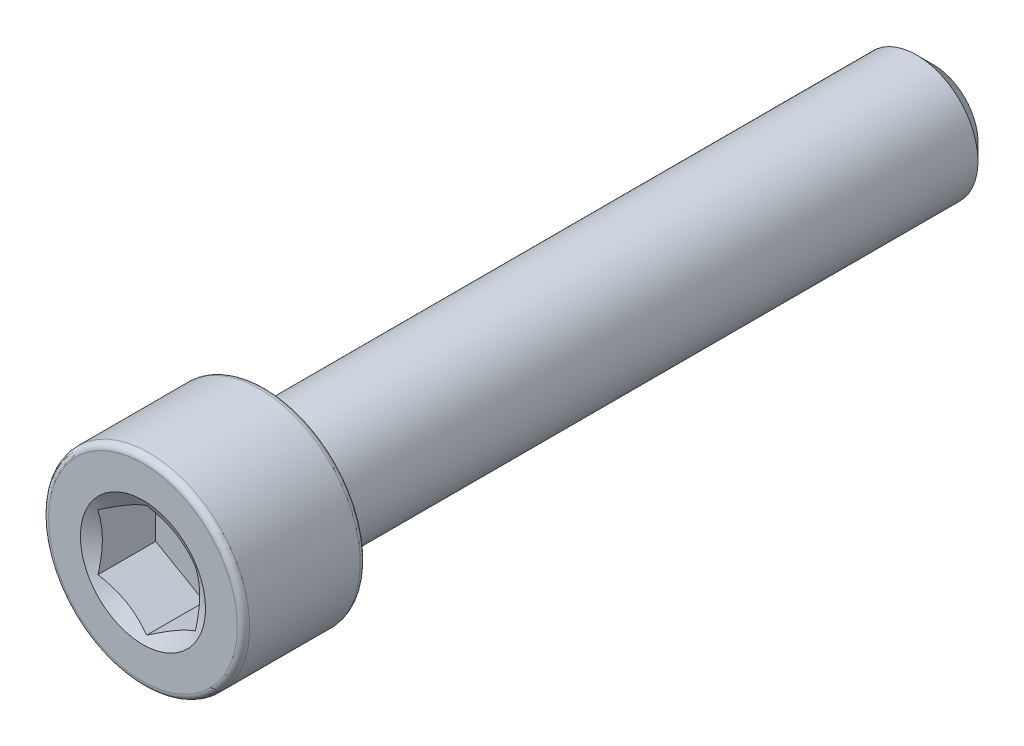
ISO-10303-21;
HEADER;
FILE_DESCRIPTION(('STEP AP214'),'2;1');
FILE_NAME('part.step','',(''),(''),'','','');
FILE_SCHEMA(('AUTOMOTIVE_DESIGN { 1 0 10303 214 1 1 1 1 }'));
ENDSEC;
DATA;
#1=APPLICATION_CONTEXT('core data for automotive mechanical design processes');
#2=APPLICATION_PROTOCOL_DEFINITION('international standard','automotive_design',2000,#1);
#3=PRODUCT_CONTEXT('',#1,'mechanical');
#4=PRODUCT('Part','Part','',(#3));
#5=PRODUCT_RELATED_PRODUCT_CATEGORY('part','',(#4));
#6=PRODUCT_DEFINITION_FORMATION('','',#4);
#7=PRODUCT_DEFINITION_CONTEXT('part definition',#1,'design');
#8=PRODUCT_DEFINITION('design','',#6,#7);
#9=PRODUCT_DEFINITION_SHAPE('','',#8);
#10=(LENGTH_UNIT() NAMED_UNIT(*) SI_UNIT(.MILLI.,.METRE.));
#11=(NAMED_UNIT(*) PLANE_ANGLE_UNIT() SI_UNIT($,.RADIAN.));
#12=(NAMED_UNIT(*) SI_UNIT($,.STERADIAN.) SOLID_ANGLE_UNIT());
#13=UNCERTAINTY_MEASURE_WITH_UNIT(LENGTH_MEASURE(1.E-05),#10,'distance_accuracy_value','');
#14=(GEOMETRIC_REPRESENTATION_CONTEXT(3) GLOBAL_UNCERTAINTY_ASSIGNED_CONTEXT((#13)) GLOBAL_UNIT_ASSIGNED_CONTEXT((#10,
#11,#12)) REPRESENTATION_CONTEXT('',''));
#15=CARTESIAN_POINT('',(0.,0.,0.));
#16=DIRECTION('',(0.,0.,1.));
#17=DIRECTION('',(1.,0.,0.));
#18=AXIS2_PLACEMENT_3D('',#15,#16,#17);
#19=CARTESIAN_POINT('',(0.,0.,-11.2776));
#20=DIRECTION('',(0.,0.,-1.));
#21=DIRECTION('',(-1.,0.,0.));
#22=AXIS2_PLACEMENT_3D('',#19,#20,#21);
#23=PLANE('',#22);
#24=CARTESIAN_POINT('',(0.,0.,-11.2776));
#25=DIRECTION('',(0.,0.,-1.));
#26=DIRECTION('',(-1.,0.,0.));
#27=AXIS2_PLACEMENT_3D('',#24,#25,#26);
#28=CIRCLE('',#27,1.27635000000001);
#29=CARTESIAN_POINT('',(-1.27635000000001,0.,-11.2776));
#30=VERTEX_POINT('',#29);
#31=EDGE_CURVE('E57',#30,#30,#28,.T.);
#32=ORIENTED_EDGE('',*,*,#31,.T.);
#33=EDGE_LOOP('',(#32));
#34=FACE_BOUND('',#33,.T.);
#35=ADVANCED_FACE('F43',(#34),#23,.T.);
#36=CARTESIAN_POINT('',(0.,0.,-11.2776));
#37=DIRECTION('',(0.,0.,1.));
#38=DIRECTION('',(1.,0.,0.));
#39=AXIS2_PLACEMENT_3D('',#36,#37,#38);
#40=CONICAL_SURFACE('',#39,1.27635000000001,0.785398163397449);
#41=CARTESIAN_POINT('',(0.,0.,-10.80135));
#42=DIRECTION('',(0.,0.,-1.));
#43=DIRECTION('',(-1.,0.,0.));
#44=AXIS2_PLACEMENT_3D('',#41,#42,#43);
#45=CIRCLE('',#44,1.75260000000001);
#46=CARTESIAN_POINT('',(-1.75260000000001,0.,-10.80135));
#47=VERTEX_POINT('',#46);
#48=EDGE_CURVE('E151',#47,#47,#45,.T.);
#49=ORIENTED_EDGE('',*,*,#48,.T.);
#50=EDGE_LOOP('',(#49));
#51=FACE_BOUND('',#50,.T.);
#52=ORIENTED_EDGE('',*,*,#31,.F.);
#53=EDGE_LOOP('',(#52));
#54=FACE_BOUND('',#53,.T.);
#55=ADVANCED_FACE('F159',(#51,#54),#40,.T.);
#56=CARTESIAN_POINT('',(0.,0.,-11.2776));
#57=DIRECTION('',(0.,0.,-1.));
#58=DIRECTION('',(-1.,0.,0.));
#59=AXIS2_PLACEMENT_3D('',#56,#57,#58);
#60=CYLINDRICAL_SURFACE('',#59,1.75260000000001);
#61=CARTESIAN_POINT('',(0.,0.,7.7724));
#62=DIRECTION('',(0.,0.,-1.));
#63=DIRECTION('',(-1.,0.,0.));
#64=AXIS2_PLACEMENT_3D('',#61,#62,#63);
#65=CIRCLE('',#64,1.75260000000001);
#66=CARTESIAN_POINT('',(-1.75260000000001,0.,7.7724));
#67=VERTEX_POINT('',#66);
#68=EDGE_CURVE('E147',#67,#67,#65,.T.);
#69=ORIENTED_EDGE('',*,*,#68,.T.);
#70=EDGE_LOOP('',(#69));
#71=FACE_BOUND('',#70,.T.);
#72=ORIENTED_EDGE('',*,*,#48,.F.);
#73=EDGE_LOOP('',(#72));
#74=FACE_BOUND('',#73,.T.);
#75=ADVANCED_FACE('F161',(#71,#74),#60,.T.);
#76=CARTESIAN_POINT('',(0.,1.7526,7.7724));
#77=DIRECTION('',(0.,0.,-1.));
#78=DIRECTION('',(-1.,0.,0.));
#79=AXIS2_PLACEMENT_3D('',#76,#77,#78);
#80=PLANE('',#79);
#81=CARTESIAN_POINT('',(0.,0.,7.7724));
#82=DIRECTION('',(0.,0.,-1.));
#83=DIRECTION('',(-1.,0.,0.));
#84=AXIS2_PLACEMENT_3D('',#81,#82,#83);
#85=CIRCLE('',#84,2.69494);
#86=CARTESIAN_POINT('',(-2.69494,0.,7.7724));
#87=VERTEX_POINT('',#86);
#88=EDGE_CURVE('E143',#87,#87,#85,.T.);
#89=ORIENTED_EDGE('',*,*,#88,.T.);
#90=EDGE_LOOP('',(#89));
#91=FACE_BOUND('',#90,.T.);
#92=ORIENTED_EDGE('',*,*,#68,.F.);
#93=EDGE_LOOP('',(#92));
#94=FACE_BOUND('',#93,.T.);
#95=ADVANCED_FACE('F168',(#91,#94),#80,.T.);
#96=CARTESIAN_POINT('',(0.,0.,7.94766));
#97=DIRECTION('',(0.,0.,-1.));
#98=DIRECTION('',(-1.,0.,0.));
#99=AXIS2_PLACEMENT_3D('',#96,#97,#98);
#100=TOROIDAL_SURFACE('',#99,2.69494,0.175259999999999);
#101=CARTESIAN_POINT('',(0.,0.,7.94766));
#102=DIRECTION('',(0.,0.,-1.));
#103=DIRECTION('',(-1.,0.,0.));
#104=AXIS2_PLACEMENT_3D('',#101,#102,#103);
#105=CIRCLE('',#104,2.8702);
#106=CARTESIAN_POINT('',(-2.8702,0.,7.94766));
#107=VERTEX_POINT('',#106);
#108=EDGE_CURVE('E139',#107,#107,#105,.T.);
#109=ORIENTED_EDGE('',*,*,#108,.T.);
#110=EDGE_LOOP('',(#109));
#111=FACE_BOUND('',#110,.T.);
#112=ORIENTED_EDGE('',*,*,#88,.F.);
#113=EDGE_LOOP('',(#112));
#114=FACE_BOUND('',#113,.T.);
#115=ADVANCED_FACE('F174',(#111,#114),#100,.T.);
#116=CARTESIAN_POINT('',(0.,0.,-11.2776));
#117=DIRECTION('',(0.,0.,-1.));
#118=DIRECTION('',(-1.,0.,0.));
#119=AXIS2_PLACEMENT_3D('',#116,#117,#118);
#120=CYLINDRICAL_SURFACE('',#119,2.8702);
#121=CARTESIAN_POINT('',(0.,0.,11.10234));
#122=DIRECTION('',(0.,0.,-1.));
#123=DIRECTION('',(-1.,0.,0.));
#124=AXIS2_PLACEMENT_3D('',#121,#122,#123);
#125=CIRCLE('',#124,2.8702);
#126=CARTESIAN_POINT('',(-2.8702,0.,11.10234));
#127=VERTEX_POINT('',#126);
#128=EDGE_CURVE('E135',#127,#127,#125,.T.);
#129=ORIENTED_EDGE('',*,*,#128,.T.);
#130=EDGE_LOOP('',(#129));
#131=FACE_BOUND('',#130,.T.);
#132=ORIENTED_EDGE('',*,*,#108,.F.);
#133=EDGE_LOOP('',(#132));
#134=FACE_BOUND('',#133,.T.);
#135=ADVANCED_FACE('F178',(#131,#134),#120,.T.);
#136=CARTESIAN_POINT('',(0.,0.,11.10234));
#137=DIRECTION('',(0.,0.,-1.));
#138=DIRECTION('',(-1.,0.,0.));
#139=AXIS2_PLACEMENT_3D('',#136,#137,#138);
#140=TOROIDAL_SURFACE('',#139,2.69494,0.17526);
#141=CARTESIAN_POINT('',(0.,0.,11.2776));
#142=DIRECTION('',(0.,0.,-1.));
#143=DIRECTION('',(-1.,0.,0.));
#144=AXIS2_PLACEMENT_3D('',#141,#142,#143);
#145=CIRCLE('',#144,2.69494);
#146=CARTESIAN_POINT('',(-2.69494,0.,11.2776));
#147=VERTEX_POINT('',#146);
#148=EDGE_CURVE('E131',#147,#147,#145,.T.);
#149=ORIENTED_EDGE('',*,*,#148,.T.);
#150=EDGE_LOOP('',(#149));
#151=FACE_BOUND('',#150,.T.);
#152=ORIENTED_EDGE('',*,*,#128,.F.);
#153=EDGE_LOOP('',(#152));
#154=FACE_BOUND('',#153,.T.);
#155=ADVANCED_FACE('F182',(#151,#154),#140,.T.);
#156=CARTESIAN_POINT('',(0.,2.69494,11.2776));
#157=DIRECTION('',(0.,0.,1.));
#158=DIRECTION('',(1.,0.,0.));
#159=AXIS2_PLACEMENT_3D('',#156,#157,#158);
#160=PLANE('',#159);
#161=CARTESIAN_POINT('',(0.,0.,11.2776));
#162=DIRECTION('',(0.,0.,1.));
#163=DIRECTION('',(1.,0.,0.));
#164=AXIS2_PLACEMENT_3D('',#161,#162,#163);
#165=CIRCLE('',#164,1.78578268049369);
#166=CARTESIAN_POINT('',(1.78578268049369,0.,11.2776));
#167=VERTEX_POINT('',#166);
#168=EDGE_CURVE('E290',#167,#167,#165,.T.);
#169=ORIENTED_EDGE('',*,*,#168,.F.);
#170=EDGE_LOOP('',(#169));
#171=FACE_BOUND('',#170,.T.);
#172=ORIENTED_EDGE('',*,*,#148,.F.);
#173=EDGE_LOOP('',(#172));
#174=FACE_BOUND('',#173,.T.);
#175=ADVANCED_FACE('F186',(#171,#174),#160,.T.);
#176=CARTESIAN_POINT('',(0.,0.,11.2776));
#177=DIRECTION('',(0.,0.,1.));
#178=DIRECTION('',(1.,0.,0.));
#179=AXIS2_PLACEMENT_3D('',#176,#177,#178);
#180=CONICAL_SURFACE('',#179,1.78578268049369,1.0471975511966);
#181=ORIENTED_EDGE('',*,*,#168,.T.);
#182=EDGE_LOOP('',(#181));
#183=FACE_BOUND('',#182,.T.);
#184=CARTESIAN_POINT('',(1.38926249999999,0.801860138242374,11.1726862292347));
#185=CARTESIAN_POINT('',(1.32821824013092,0.837104058110265,11.1523278939438));
#186=CARTESIAN_POINT('',(1.26664705454763,0.872652198681102,11.1338122172007));
#187=CARTESIAN_POINT('',(1.14243834439444,0.944364130923743,11.1014917400971));
#188=CARTESIAN_POINT('',(1.07979861155633,0.980529197539789,11.0876983755685));
#189=CARTESIAN_POINT('',(0.95529551007821,1.05241109669313,11.0662253830542));
#190=CARTESIAN_POINT('',(0.893451306214435,1.0881168644417,11.0584028682693));
#191=CARTESIAN_POINT('',(0.769471656186877,1.15969654875914,11.0490616246604));
#192=CARTESIAN_POINT('',(0.707336661150981,1.19557020486921,11.0475351634313));
#193=CARTESIAN_POINT('',(0.591217727920771,1.26261150222769,11.0506978139943));
#194=CARTESIAN_POINT('',(0.537216474345994,1.29378914051566,11.0546103838987));
#195=CARTESIAN_POINT('',(0.429565812557947,1.35594127907743,11.0670149490911));
#196=CARTESIAN_POINT('',(0.375916777145071,1.38691556411482,11.0755111885204));
#197=CARTESIAN_POINT('',(0.268043864242601,1.44919601941733,11.0967527093422));
#198=CARTESIAN_POINT('',(0.213833651262381,1.48049430047429,11.1095881013478));
#199=CARTESIAN_POINT('',(0.106222113168661,1.54262385096061,11.1387199998421));
#200=CARTESIAN_POINT('',(0.0528194076279253,1.57345591738,11.1550096540278));
#201=CARTESIAN_POINT('',(-0.000200000000001679,1.60406668664626,11.1726862292347));
#202=B_SPLINE_CURVE_WITH_KNOTS('',3,(#184,#185,#186,#187,#188,#189,#190,#191,#192,#193,#194,
#195,#196,#197,#198,#199,#200,#201),.UNSPECIFIED.,.F.,.F.,(4,2,2,2,2,2,2,2,4),(0.,
0.220193340404851,0.440916203543966,0.656175317558362,0.871169985415865,1.05842536263794,
1.24585442291107,1.43744291582433,1.62865484718206),.UNSPECIFIED.);
#203=CARTESIAN_POINT('',(1.3890625,0.801975608296211,11.1726195553695));
#204=VERTEX_POINT('',#203);
#205=CARTESIAN_POINT('',(0.,1.60395121659242,11.1726195553695));
#206=VERTEX_POINT('',#205);
#207=EDGE_CURVE('E112',#204,#206,#202,.T.);
#208=ORIENTED_EDGE('',*,*,#207,.F.);
#209=CARTESIAN_POINT('',(1.3890625,-2.10188873687468,11.7011604051094));
#210=CARTESIAN_POINT('',(1.3890625,-2.04161377237019,11.672136128224));
#211=CARTESIAN_POINT('',(1.3890625,-1.98119474190942,11.643405917011));
#212=CARTESIAN_POINT('',(1.3890625,-1.85999136128149,11.5867000601089));
#213=CARTESIAN_POINT('',(1.3890625,-1.79920695002145,11.5587245451557));
#214=CARTESIAN_POINT('',(1.3890625,-1.67685674191202,11.5035424468678));
#215=CARTESIAN_POINT('',(1.3890625,-1.61528845109905,11.4763413688364));
#216=CARTESIAN_POINT('',(1.3890625,-1.49164412780929,11.4231261482399));
#217=CARTESIAN_POINT('',(1.3890625,-1.42956812126349,11.3971119454974));
#218=CARTESIAN_POINT('',(1.3890625,-1.30306457943466,11.3458777739664));
#219=CARTESIAN_POINT('',(1.3890625,-1.23861969285488,11.3207000840046));
#220=CARTESIAN_POINT('',(1.3890625,-1.10897062895285,11.2723889332974));
#221=CARTESIAN_POINT('',(1.3890625,-1.04376635839437,11.2492557266306));
#222=CARTESIAN_POINT('',(1.3890625,-0.847108170559878,11.1838723323779));
#223=CARTESIAN_POINT('',(1.3890625,-0.71425926875105,11.1454902966326));
#224=CARTESIAN_POINT('',(1.3890625,-0.512460037595549,11.1006487988545));
#225=CARTESIAN_POINT('',(1.3890625,-0.444928485319853,11.0878382895809));
#226=CARTESIAN_POINT('',(1.3890625,-0.309079850124471,11.0672949328794));
#227=CARTESIAN_POINT('',(1.3890625,-0.240762829524779,11.0595616854059));
#228=CARTESIAN_POINT('',(1.3890625,-0.104556203642024,11.0498884992895));
#229=CARTESIAN_POINT('',(1.3890625,-0.0366717221731944,11.0478782705985));
#230=CARTESIAN_POINT('',(1.3890625,0.0990208865343533,11.0496326143219));
#231=CARTESIAN_POINT('',(1.3890625,0.166829009393246,11.0533975026331));
#232=CARTESIAN_POINT('',(1.3890625,0.332690217324506,11.0693382628072));
#233=CARTESIAN_POINT('',(1.3890625,0.430450473822564,11.0845642865875));
#234=CARTESIAN_POINT('',(1.3890625,0.624111886650979,11.1242138378008));
#235=CARTESIAN_POINT('',(1.3890625,0.720010712586318,11.1486481994345));
#236=CARTESIAN_POINT('',(1.3890625,0.863457805343386,11.1905605875141));
#237=CARTESIAN_POINT('',(1.3890625,0.911744233295917,11.2056072499921));
#238=CARTESIAN_POINT('',(1.3890625,1.00781459305766,11.2371369118097));
#239=CARTESIAN_POINT('',(1.3890625,1.05559881475712,11.2536190250055));
#240=CARTESIAN_POINT('',(1.3890625,1.15072730793629,11.2877761157426));
#241=CARTESIAN_POINT('',(1.3890625,1.19807164787448,11.3054509040073));
#242=CARTESIAN_POINT('',(1.3890625,1.29238372619364,11.3417976047719));
#243=CARTESIAN_POINT('',(1.3890625,1.33935140084155,11.3604696820866));
#244=CARTESIAN_POINT('',(1.3890625,1.46148387921677,11.4102756215291));
#245=CARTESIAN_POINT('',(1.3890625,1.53638059548506,11.4420662474881));
#246=CARTESIAN_POINT('',(1.3890625,1.68547134969507,11.5072592087953));
#247=CARTESIAN_POINT('',(1.3890625,1.75966532803255,11.5406616794168));
#248=CARTESIAN_POINT('',(1.3890625,1.98143410428438,11.6427071707323));
#249=CARTESIAN_POINT('',(1.3890625,2.12816688116988,11.7131761247782));
#250=CARTESIAN_POINT('',(1.3890625,2.42035573672688,11.8571556683376));
#251=CARTESIAN_POINT('',(1.3890625,2.56580986555581,11.9306701653461));
#252=CARTESIAN_POINT('',(1.3890625,2.85570139416835,12.0796228406063));
#253=CARTESIAN_POINT('',(1.3890625,3.0001389363826,12.1550607422428));
#254=CARTESIAN_POINT('',(1.3890625,3.27419643459869,12.2997961321201));
#255=CARTESIAN_POINT('',(1.3890625,3.40388142099232,12.3689709297958));
#256=CARTESIAN_POINT('',(1.3890625,3.66283315266335,12.5081112985253));
#257=CARTESIAN_POINT('',(1.3890625,3.79209988014282,12.5780769026751));
#258=CARTESIAN_POINT('',(1.3890625,4.04995903997895,12.7184064240523));
#259=CARTESIAN_POINT('',(1.3890625,4.17855234970263,12.7887687312888));
#260=CARTESIAN_POINT('',(1.3890625,4.43547876758046,12.9299495549122));
#261=CARTESIAN_POINT('',(1.3890625,4.56381189026434,13.0007680448471));
#262=CARTESIAN_POINT('',(1.3890625,4.69205214902406,13.0717532813742));
#263=B_SPLINE_CURVE_WITH_KNOTS('',3,(#209,#210,#211,#212,#213,#214,#215,#216,#217,#218,#219,
#220,#221,#222,#223,#224,#225,#226,#227,#228,#229,#230,#231,#232,#233,#234,#235,#236,#237,#238,
#239,#240,#241,#242,#243,#244,#245,#246,#247,#248,#249,#250,#251,#252,#253,#254,#255,#256,#257,
#258,#259,#260,#261,#262),.UNSPECIFIED.,.F.,.F.,(4,2,2,2,2,2,2,2,2,2,2,2,2,2,2,2,2,2,2,2,2,2,2,
2,2,2,4),(0.,0.200699530385657,0.401433607492383,0.603351061959748,0.805258267336892,
1.01278698702049,1.22034146123214,1.63431309049283,1.84036730788069,2.04640528797708,
2.24990156104279,2.45340896567644,2.74961762430218,3.04617588503693,3.19788810550421,
3.34950732478951,3.50110253854759,3.65272288332758,3.89678819262209,4.14087402073153,
4.62913956389935,5.11805223764829,5.60689499047604,6.04783423698463,6.48879200606717,
6.92854531099338,7.36827334211845),.UNSPECIFIED.);
#264=CARTESIAN_POINT('',(1.3890625,-0.801975608296212,11.1726195553695));
#265=VERTEX_POINT('',#264);
#266=EDGE_CURVE('E232',#265,#204,#263,.T.);
#267=ORIENTED_EDGE('',*,*,#266,.F.);
#268=CARTESIAN_POINT('',(-0.000200000000001787,-1.60406668664626,11.1726862292347));
#269=CARTESIAN_POINT('',(0.0608442598690719,-1.56882276677837,11.1523278939438));
#270=CARTESIAN_POINT('',(0.122415445452363,-1.53327462620753,11.1338122172007));
#271=CARTESIAN_POINT('',(0.246624155605553,-1.46156269396489,11.1014917400971));
#272=CARTESIAN_POINT('',(0.309263888443659,-1.42539762734885,11.0876983755685));
#273=CARTESIAN_POINT('',(0.433766989921784,-1.35351572819551,11.0662253830542));
#274=CARTESIAN_POINT('',(0.495611193785559,-1.31780996044694,11.0584028682693));
#275=CARTESIAN_POINT('',(0.619590843813117,-1.24623027612949,11.0490616246604));
#276=CARTESIAN_POINT('',(0.681725838849013,-1.21035662001942,11.0475351634313));
#277=CARTESIAN_POINT('',(0.797844772079223,-1.14331532266095,11.0506978139943));
#278=CARTESIAN_POINT('',(0.851846025654,-1.11213768437297,11.0546103838987));
#279=CARTESIAN_POINT('',(0.959496687442047,-1.0499855458112,11.0670149490911));
#280=CARTESIAN_POINT('',(1.01314572285492,-1.01901126077382,11.0755111885204));
#281=CARTESIAN_POINT('',(1.12101863575739,-0.956730805471306,11.0967527093422));
#282=CARTESIAN_POINT('',(1.17522884873761,-0.925432524414349,11.1095881013478));
#283=CARTESIAN_POINT('',(1.28284038683133,-0.86330297392803,11.1387199998421));
#284=CARTESIAN_POINT('',(1.33624309237207,-0.832470907508632,11.1550096540278));
#285=CARTESIAN_POINT('',(1.3892625,-0.801860138242374,11.1726862292347));
#286=B_SPLINE_CURVE_WITH_KNOTS('',3,(#268,#269,#270,#271,#272,#273,#274,#275,#276,#277,#278,
#279,#280,#281,#282,#283,#284,#285),.UNSPECIFIED.,.F.,.F.,(4,2,2,2,2,2,2,2,4),(0.,
0.220193340404852,0.440916203543967,0.656175317558363,0.871169985415867,1.05842536263795,
1.24585442291107,1.43744291582434,1.62865484718206),.UNSPECIFIED.);
#287=CARTESIAN_POINT('',(0.,-1.60395121659242,11.1726195553695));
#288=VERTEX_POINT('',#287);
#289=EDGE_CURVE('E226',#288,#265,#286,.T.);
#290=ORIENTED_EDGE('',*,*,#289,.F.);
#291=CARTESIAN_POINT('',(-1.3892625,-0.801860138242375,11.1726862292347));
#292=CARTESIAN_POINT('',(-1.32821824013092,-0.837104058110267,11.1523278939438));
#293=CARTESIAN_POINT('',(-1.26664705454763,-0.872652198681104,11.1338122172007));
#294=CARTESIAN_POINT('',(-1.14243834439444,-0.944364130923745,11.1014917400971));
#295=CARTESIAN_POINT('',(-1.07979861155634,-0.980529197539791,11.0876983755685));
#296=CARTESIAN_POINT('',(-0.955295510078211,-1.05241109669313,11.0662253830542));
#297=CARTESIAN_POINT('',(-0.893451306214435,-1.0881168644417,11.0584028682693));
#298=CARTESIAN_POINT('',(-0.769471656186878,-1.15969654875914,11.0490616246604));
#299=CARTESIAN_POINT('',(-0.707336661150981,-1.19557020486922,11.0475351634313));
#300=CARTESIAN_POINT('',(-0.591217727920772,-1.26261150222769,11.0506978139943));
#301=CARTESIAN_POINT('',(-0.537216474345994,-1.29378914051566,11.0546103838987));
#302=CARTESIAN_POINT('',(-0.429565812557948,-1.35594127907743,11.0670149490911));
#303=CARTESIAN_POINT('',(-0.375916777145071,-1.38691556411482,11.0755111885204));
#304=CARTESIAN_POINT('',(-0.268043864242602,-1.44919601941733,11.0967527093422));
#305=CARTESIAN_POINT('',(-0.213833651262382,-1.48049430047429,11.1095881013478));
#306=CARTESIAN_POINT('',(-0.106222113168663,-1.54262385096061,11.1387199998421));
#307=CARTESIAN_POINT('',(-0.0528194076279276,-1.57345591738,11.1550096540278));
#308=CARTESIAN_POINT('',(0.000199999999998485,-1.60406668664626,11.1726862292347));
#309=B_SPLINE_CURVE_WITH_KNOTS('',3,(#291,#292,#293,#294,#295,#296,#297,#298,#299,#300,#301,
#302,#303,#304,#305,#306,#307,#308),.UNSPECIFIED.,.F.,.F.,(4,2,2,2,2,2,2,2,4),(0.,
0.220193340404852,0.440916203543967,0.656175317558363,0.871169985415866,1.05842536263795,
1.24585442291107,1.43744291582433,1.62865484718206),.UNSPECIFIED.);
#310=CARTESIAN_POINT('',(-1.3890625,-0.801975608296213,11.1726195553695));
#311=VERTEX_POINT('',#310);
#312=EDGE_CURVE('E64',#311,#288,#309,.T.);
#313=ORIENTED_EDGE('',*,*,#312,.F.);
#314=CARTESIAN_POINT('',(-1.3890625,-2.10188873687468,11.7011604051094));
#315=CARTESIAN_POINT('',(-1.3890625,-2.04161377237019,11.672136128224));
#316=CARTESIAN_POINT('',(-1.3890625,-1.98119474190942,11.643405917011));
#317=CARTESIAN_POINT('',(-1.3890625,-1.85999136128148,11.5867000601089));
#318=CARTESIAN_POINT('',(-1.3890625,-1.79920695002145,11.5587245451557));
#319=CARTESIAN_POINT('',(-1.3890625,-1.67685674191202,11.5035424468678));
#320=CARTESIAN_POINT('',(-1.3890625,-1.61528845109905,11.4763413688364));
#321=CARTESIAN_POINT('',(-1.3890625,-1.49164412780929,11.4231261482399));
#322=CARTESIAN_POINT('',(-1.3890625,-1.42956812126349,11.3971119454974));
#323=CARTESIAN_POINT('',(-1.3890625,-1.30306457943466,11.3458777739664));
#324=CARTESIAN_POINT('',(-1.3890625,-1.23861969285488,11.3207000840046));
#325=CARTESIAN_POINT('',(-1.3890625,-1.10897062895285,11.2723889332974));
#326=CARTESIAN_POINT('',(-1.3890625,-1.04376635839437,11.2492557266306));
#327=CARTESIAN_POINT('',(-1.3890625,-0.847108170559878,11.1838723323779));
#328=CARTESIAN_POINT('',(-1.3890625,-0.71425926875105,11.1454902966326));
#329=CARTESIAN_POINT('',(-1.3890625,-0.512460037595549,11.1006487988545));
#330=CARTESIAN_POINT('',(-1.3890625,-0.444928485319853,11.0878382895809));
#331=CARTESIAN_POINT('',(-1.3890625,-0.309079850124471,11.0672949328794));
#332=CARTESIAN_POINT('',(-1.3890625,-0.240762829524779,11.0595616854059));
#333=CARTESIAN_POINT('',(-1.3890625,-0.104556203642025,11.0498884992895));
#334=CARTESIAN_POINT('',(-1.3890625,-0.0366717221731944,11.0478782705985));
#335=CARTESIAN_POINT('',(-1.3890625,0.0990208865343532,11.0496326143219));
#336=CARTESIAN_POINT('',(-1.3890625,0.166829009393245,11.0533975026331));
#337=CARTESIAN_POINT('',(-1.3890625,0.332690217324506,11.0693382628072));
#338=CARTESIAN_POINT('',(-1.3890625,0.430450473822564,11.0845642865875));
#339=CARTESIAN_POINT('',(-1.3890625,0.624111886650979,11.1242138378008));
#340=CARTESIAN_POINT('',(-1.3890625,0.720010712586318,11.1486481994345));
#341=CARTESIAN_POINT('',(-1.3890625,0.863457805343386,11.1905605875141));
#342=CARTESIAN_POINT('',(-1.3890625,0.911744233295916,11.2056072499921));
#343=CARTESIAN_POINT('',(-1.3890625,1.00781459305766,11.2371369118097));
#344=CARTESIAN_POINT('',(-1.3890625,1.05559881475712,11.2536190250055));
#345=CARTESIAN_POINT('',(-1.3890625,1.15072730793629,11.2877761157426));
#346=CARTESIAN_POINT('',(-1.3890625,1.19807164787448,11.3054509040073));
#347=CARTESIAN_POINT('',(-1.3890625,1.29238372619364,11.3417976047719));
#348=CARTESIAN_POINT('',(-1.3890625,1.33935140084155,11.3604696820866));
#349=CARTESIAN_POINT('',(-1.3890625,1.46148387921677,11.4102756215291));
#350=CARTESIAN_POINT('',(-1.3890625,1.53638059548506,11.4420662474881));
#351=CARTESIAN_POINT('',(-1.3890625,1.68547134969507,11.5072592087953));
#352=CARTESIAN_POINT('',(-1.3890625,1.75966532803255,11.5406616794168));
#353=CARTESIAN_POINT('',(-1.3890625,1.98143410428438,11.6427071707323));
#354=CARTESIAN_POINT('',(-1.3890625,2.12816688116988,11.7131761247782));
#355=CARTESIAN_POINT('',(-1.3890625,2.42035573672688,11.8571556683376));
#356=CARTESIAN_POINT('',(-1.3890625,2.56580986555581,11.9306701653461));
#357=CARTESIAN_POINT('',(-1.3890625,2.85570139416835,12.0796228406063));
#358=CARTESIAN_POINT('',(-1.3890625,3.0001389363826,12.1550607422428));
#359=CARTESIAN_POINT('',(-1.3890625,3.27419643459869,12.2997961321201));
#360=CARTESIAN_POINT('',(-1.3890625,3.40388142099232,12.3689709297958));
#361=CARTESIAN_POINT('',(-1.3890625,3.66283315266336,12.5081112985253));
#362=CARTESIAN_POINT('',(-1.3890625,3.79209988014282,12.5780769026751));
#363=CARTESIAN_POINT('',(-1.3890625,4.04995903997895,12.7184064240523));
#364=CARTESIAN_POINT('',(-1.3890625,4.17855234970263,12.7887687312888));
#365=CARTESIAN_POINT('',(-1.3890625,4.43547876758047,12.9299495549122));
#366=CARTESIAN_POINT('',(-1.3890625,4.56381189026435,13.0007680448471));
#367=CARTESIAN_POINT('',(-1.3890625,4.69205214902406,13.0717532813742));
#368=B_SPLINE_CURVE_WITH_KNOTS('',3,(#314,#315,#316,#317,#318,#319,#320,#321,#322,#323,#324,
#325,#326,#327,#328,#329,#330,#331,#332,#333,#334,#335,#336,#337,#338,#339,#340,#341,#342,#343,
#344,#345,#346,#347,#348,#349,#350,#351,#352,#353,#354,#355,#356,#357,#358,#359,#360,#361,#362,
#363,#364,#365,#366,#367),.UNSPECIFIED.,.F.,.F.,(4,2,2,2,2,2,2,2,2,2,2,2,2,2,2,2,2,2,2,2,2,2,2,
2,2,2,4),(0.,0.200699530385658,0.401433607492383,0.603351061959748,0.805258267336892,
1.01278698702049,1.22034146123214,1.63431309049283,1.84036730788069,2.04640528797708,
2.24990156104279,2.45340896567644,2.74961762430218,3.04617588503693,3.19788810550421,
3.34950732478951,3.50110253854759,3.65272288332757,3.89678819262208,4.14087402073152,
4.62913956389935,5.11805223764829,5.60689499047604,6.04783423698463,6.48879200606718,
6.92854531099338,7.36827334211846),.UNSPECIFIED.);
#369=CARTESIAN_POINT('',(-1.3890625,0.801975608296213,11.1726195553695));
#370=VERTEX_POINT('',#369);
#371=EDGE_CURVE('E11',#370,#311,#368,.F.);
#372=ORIENTED_EDGE('',*,*,#371,.F.);
#373=CARTESIAN_POINT('',(0.000199999999998317,1.60406668664626,11.1726862292347));
#374=CARTESIAN_POINT('',(-0.0608442598690755,1.56882276677837,11.1523278939438));
#375=CARTESIAN_POINT('',(-0.122415445452366,1.53327462620753,11.1338122172007));
#376=CARTESIAN_POINT('',(-0.246624155605557,1.46156269396489,11.1014917400971));
#377=CARTESIAN_POINT('',(-0.309263888443662,1.42539762734885,11.0876983755685));
#378=CARTESIAN_POINT('',(-0.433766989921787,1.35351572819551,11.0662253830542));
#379=CARTESIAN_POINT('',(-0.495611193785562,1.31780996044694,11.0584028682693));
#380=CARTESIAN_POINT('',(-0.61959084381312,1.24623027612949,11.0490616246604));
#381=CARTESIAN_POINT('',(-0.681725838849017,1.21035662001942,11.0475351634313));
#382=CARTESIAN_POINT('',(-0.797844772079226,1.14331532266095,11.0506978139943));
#383=CARTESIAN_POINT('',(-0.851846025654004,1.11213768437297,11.0546103838987));
#384=CARTESIAN_POINT('',(-0.95949668744205,1.0499855458112,11.0670149490911));
#385=CARTESIAN_POINT('',(-1.01314572285493,1.01901126077382,11.0755111885204));
#386=CARTESIAN_POINT('',(-1.1210186357574,0.956730805471306,11.0967527093422));
#387=CARTESIAN_POINT('',(-1.17522884873762,0.925432524414349,11.1095881013478));
#388=CARTESIAN_POINT('',(-1.28284038683133,0.863302973928031,11.1387199998421));
#389=CARTESIAN_POINT('',(-1.33624309237207,0.832470907508633,11.1550096540278));
#390=CARTESIAN_POINT('',(-1.3892625,0.801860138242375,11.1726862292347));
#391=B_SPLINE_CURVE_WITH_KNOTS('',3,(#373,#374,#375,#376,#377,#378,#379,#380,#381,#382,#383,
#384,#385,#386,#387,#388,#389,#390),.UNSPECIFIED.,.F.,.F.,(4,2,2,2,2,2,2,2,4),(0.,
0.220193340404852,0.440916203543967,0.656175317558363,0.871169985415867,1.05842536263795,
1.24585442291107,1.43744291582433,1.62865484718206),.UNSPECIFIED.);
#392=EDGE_CURVE('E102',#206,#370,#391,.T.);
#393=ORIENTED_EDGE('',*,*,#392,.F.);
#394=EDGE_LOOP('',(#208,#267,#290,#313,#372,#393));
#395=FACE_BOUND('',#394,.T.);
#396=ADVANCED_FACE('F101',(#183,#395),#180,.F.);
#397=CARTESIAN_POINT('',(0.,0.,9.525));
#398=DIRECTION('',(0.,0.,1.));
#399=DIRECTION('',(1.,0.,0.));
#400=AXIS2_PLACEMENT_3D('',#397,#398,#399);
#401=PLANE('',#400);
#402=DIRECTION('',(-0.866025403784438,-0.5,0.));
#403=VECTOR('',#402,1.);
#404=CARTESIAN_POINT('',(0.,1.60395121659242,9.525));
#405=LINE('',#404,#403);
#406=CARTESIAN_POINT('',(0.,1.60395121659242,9.525));
#407=VERTEX_POINT('',#406);
#408=CARTESIAN_POINT('',(-1.3890625,0.801975608296213,9.525));
#409=VERTEX_POINT('',#408);
#410=EDGE_CURVE('E111',#407,#409,#405,.T.);
#411=ORIENTED_EDGE('',*,*,#410,.T.);
#412=DIRECTION('',(0.,-1.,0.));
#413=VECTOR('',#412,1.);
#414=CARTESIAN_POINT('',(-1.3890625,0.801975608296213,9.525));
#415=LINE('',#414,#413);
#416=CARTESIAN_POINT('',(-1.3890625,-0.801975608296213,9.525));
#417=VERTEX_POINT('',#416);
#418=EDGE_CURVE('E116',#409,#417,#415,.T.);
#419=ORIENTED_EDGE('',*,*,#418,.T.);
#420=DIRECTION('',(0.866025403784439,-0.5,0.));
#421=VECTOR('',#420,1.);
#422=CARTESIAN_POINT('',(-1.3890625,-0.801975608296213,9.525));
#423=LINE('',#422,#421);
#424=CARTESIAN_POINT('',(0.,-1.60395121659242,9.525));
#425=VERTEX_POINT('',#424);
#426=EDGE_CURVE('E259',#417,#425,#423,.T.);
#427=ORIENTED_EDGE('',*,*,#426,.T.);
#428=DIRECTION('',(0.866025403784439,0.5,0.));
#429=VECTOR('',#428,1.);
#430=CARTESIAN_POINT('',(0.,-1.60395121659242,9.525));
#431=LINE('',#430,#429);
#432=CARTESIAN_POINT('',(1.3890625,-0.801975608296212,9.525));
#433=VERTEX_POINT('',#432);
#434=EDGE_CURVE('E264',#425,#433,#431,.T.);
#435=ORIENTED_EDGE('',*,*,#434,.T.);
#436=DIRECTION('',(0.,1.,0.));
#437=VECTOR('',#436,1.);
#438=CARTESIAN_POINT('',(1.3890625,-0.801975608296212,9.525));
#439=LINE('',#438,#437);
#440=CARTESIAN_POINT('',(1.3890625,0.801975608296212,9.525));
#441=VERTEX_POINT('',#440);
#442=EDGE_CURVE('E127',#433,#441,#439,.T.);
#443=ORIENTED_EDGE('',*,*,#442,.T.);
#444=DIRECTION('',(-0.866025403784439,0.5,0.));
#445=VECTOR('',#444,1.);
#446=CARTESIAN_POINT('',(1.3890625,0.801975608296212,9.525));
#447=LINE('',#446,#445);
#448=EDGE_CURVE('E120',#441,#407,#447,.T.);
#449=ORIENTED_EDGE('',*,*,#448,.T.);
#450=EDGE_LOOP('',(#411,#419,#427,#435,#443,#449));
#451=FACE_BOUND('',#450,.T.);
#452=ADVANCED_FACE('F212',(#451),#401,.T.);
#453=CARTESIAN_POINT('',(-1.3890625,0.801975608296213,9.525));
#454=DIRECTION('',(-1.,0.,0.));
#455=DIRECTION('',(0.,0.,1.));
#456=AXIS2_PLACEMENT_3D('',#453,#454,#455);
#457=PLANE('',#456);
#458=DIRECTION('',(0.,0.,1.));
#459=VECTOR('',#458,1.);
#460=CARTESIAN_POINT('',(-1.3890625,0.801975608296213,9.525));
#461=LINE('',#460,#459);
#462=EDGE_CURVE('E108',#409,#370,#461,.T.);
#463=ORIENTED_EDGE('',*,*,#462,.T.);
#464=ORIENTED_EDGE('',*,*,#371,.T.);
#465=DIRECTION('',(0.,0.,1.));
#466=VECTOR('',#465,1.);
#467=CARTESIAN_POINT('',(-1.3890625,-0.801975608296213,9.525));
#468=LINE('',#467,#466);
#469=EDGE_CURVE('E119',#417,#311,#468,.T.);
#470=ORIENTED_EDGE('',*,*,#469,.F.);
#471=ORIENTED_EDGE('',*,*,#418,.F.);
#472=EDGE_LOOP('',(#463,#464,#470,#471));
#473=FACE_BOUND('',#472,.T.);
#474=ADVANCED_FACE('F114',(#473),#457,.F.);
#475=CARTESIAN_POINT('',(-1.3890625,-0.801975608296213,9.525));
#476=DIRECTION('',(-0.5,-0.866025403784439,0.));
#477=DIRECTION('',(0.866025403784439,-0.5,0.));
#478=AXIS2_PLACEMENT_3D('',#475,#476,#477);
#479=PLANE('',#478);
#480=ORIENTED_EDGE('',*,*,#469,.T.);
#481=ORIENTED_EDGE('',*,*,#312,.T.);
#482=DIRECTION('',(0.,0.,1.));
#483=VECTOR('',#482,1.);
#484=CARTESIAN_POINT('',(0.,-1.60395121659242,9.525));
#485=LINE('',#484,#483);
#486=EDGE_CURVE('E124',#425,#288,#485,.T.);
#487=ORIENTED_EDGE('',*,*,#486,.F.);
#488=ORIENTED_EDGE('',*,*,#426,.F.);
#489=EDGE_LOOP('',(#480,#481,#487,#488));
#490=FACE_BOUND('',#489,.T.);
#491=ADVANCED_FACE('F248',(#490),#479,.F.);
#492=CARTESIAN_POINT('',(0.,-1.60395121659242,9.525));
#493=DIRECTION('',(0.5,-0.866025403784439,0.));
#494=DIRECTION('',(0.866025403784439,0.5,0.));
#495=AXIS2_PLACEMENT_3D('',#492,#493,#494);
#496=PLANE('',#495);
#497=ORIENTED_EDGE('',*,*,#486,.T.);
#498=ORIENTED_EDGE('',*,*,#289,.T.);
#499=DIRECTION('',(0.,0.,1.));
#500=VECTOR('',#499,1.);
#501=CARTESIAN_POINT('',(1.3890625,-0.801975608296212,9.525));
#502=LINE('',#501,#500);
#503=EDGE_CURVE('E280',#433,#265,#502,.T.);
#504=ORIENTED_EDGE('',*,*,#503,.F.);
#505=ORIENTED_EDGE('',*,*,#434,.F.);
#506=EDGE_LOOP('',(#497,#498,#504,#505));
#507=FACE_BOUND('',#506,.T.);
#508=ADVANCED_FACE('F243',(#507),#496,.F.);
#509=CARTESIAN_POINT('',(1.3890625,-0.801975608296212,9.525));
#510=DIRECTION('',(1.,0.,0.));
#511=DIRECTION('',(0.,0.,-1.));
#512=AXIS2_PLACEMENT_3D('',#509,#510,#511);
#513=PLANE('',#512);
#514=ORIENTED_EDGE('',*,*,#503,.T.);
#515=ORIENTED_EDGE('',*,*,#266,.T.);
#516=DIRECTION('',(0.,0.,1.));
#517=VECTOR('',#516,1.);
#518=CARTESIAN_POINT('',(1.3890625,0.801975608296212,9.525));
#519=LINE('',#518,#517);
#520=EDGE_CURVE('E276',#441,#204,#519,.T.);
#521=ORIENTED_EDGE('',*,*,#520,.F.);
#522=ORIENTED_EDGE('',*,*,#442,.F.);
#523=EDGE_LOOP('',(#514,#515,#521,#522));
#524=FACE_BOUND('',#523,.T.);
#525=ADVANCED_FACE('F240',(#524),#513,.F.);
#526=CARTESIAN_POINT('',(1.3890625,0.801975608296212,9.525));
#527=DIRECTION('',(0.5,0.866025403784438,0.));
#528=DIRECTION('',(-0.866025403784439,0.5,0.));
#529=AXIS2_PLACEMENT_3D('',#526,#527,#528);
#530=PLANE('',#529);
#531=ORIENTED_EDGE('',*,*,#520,.T.);
#532=ORIENTED_EDGE('',*,*,#207,.T.);
#533=DIRECTION('',(0.,0.,1.));
#534=VECTOR('',#533,1.);
#535=CARTESIAN_POINT('',(0.,1.60395121659242,9.525));
#536=LINE('',#535,#534);
#537=EDGE_CURVE('E71',#407,#206,#536,.T.);
#538=ORIENTED_EDGE('',*,*,#537,.F.);
#539=ORIENTED_EDGE('',*,*,#448,.F.);
#540=EDGE_LOOP('',(#531,#532,#538,#539));
#541=FACE_BOUND('',#540,.T.);
#542=ADVANCED_FACE('F193',(#541),#530,.F.);
#543=CARTESIAN_POINT('',(0.,1.60395121659242,9.525));
#544=DIRECTION('',(-0.5,0.866025403784439,0.));
#545=DIRECTION('',(-0.866025403784439,-0.5,0.));
#546=AXIS2_PLACEMENT_3D('',#543,#544,#545);
#547=PLANE('',#546);
#548=ORIENTED_EDGE('',*,*,#537,.T.);
#549=ORIENTED_EDGE('',*,*,#392,.T.);
#550=ORIENTED_EDGE('',*,*,#462,.F.);
#551=ORIENTED_EDGE('',*,*,#410,.F.);
#552=EDGE_LOOP('',(#548,#549,#550,#551));
#553=FACE_BOUND('',#552,.T.);
#554=ADVANCED_FACE('F107',(#553),#547,.F.);
#555=CLOSED_SHELL('',(#35,#55,#75,#95,#115,#135,#155,#175,#396,#452,#474,#491,#508,#525,#542,#554));
#556=MANIFOLD_SOLID_BREP('B2',#555);
#557=ADVANCED_BREP_SHAPE_REPRESENTATION('',(#18,#556),#14);
#558=SHAPE_DEFINITION_REPRESENTATION(#9,#557);
ENDSEC;
END-ISO-10303-21;
